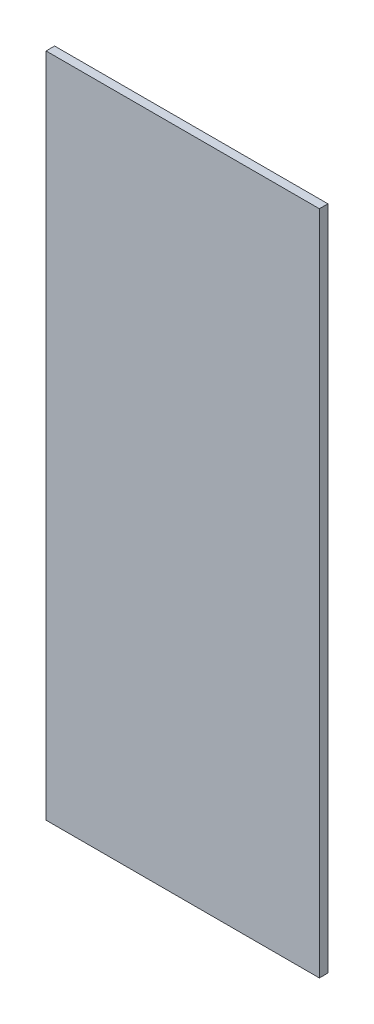
ISO-10303-21;
HEADER;
FILE_DESCRIPTION(('STEP AP214'),'2;1');
FILE_NAME('part.step','',(''),(''),'','','');
FILE_SCHEMA(('AUTOMOTIVE_DESIGN { 1 0 10303 214 1 1 1 1 }'));
ENDSEC;
DATA;
#1=APPLICATION_CONTEXT('core data for automotive mechanical design processes');
#2=APPLICATION_PROTOCOL_DEFINITION('international standard','automotive_design',2000,#1);
#3=PRODUCT_CONTEXT('',#1,'mechanical');
#4=PRODUCT('Part','Part','',(#3));
#5=PRODUCT_RELATED_PRODUCT_CATEGORY('part','',(#4));
#6=PRODUCT_DEFINITION_FORMATION('','',#4);
#7=PRODUCT_DEFINITION_CONTEXT('part definition',#1,'design');
#8=PRODUCT_DEFINITION('design','',#6,#7);
#9=PRODUCT_DEFINITION_SHAPE('','',#8);
#10=(LENGTH_UNIT() NAMED_UNIT(*) SI_UNIT(.MILLI.,.METRE.));
#11=(NAMED_UNIT(*) PLANE_ANGLE_UNIT() SI_UNIT($,.RADIAN.));
#12=(NAMED_UNIT(*) SI_UNIT($,.STERADIAN.) SOLID_ANGLE_UNIT());
#13=UNCERTAINTY_MEASURE_WITH_UNIT(LENGTH_MEASURE(1.E-05),#10,'distance_accuracy_value','');
#14=(GEOMETRIC_REPRESENTATION_CONTEXT(3) GLOBAL_UNCERTAINTY_ASSIGNED_CONTEXT((#13)) GLOBAL_UNIT_ASSIGNED_CONTEXT((#10,
#11,#12)) REPRESENTATION_CONTEXT('',''));
#15=CARTESIAN_POINT('',(0.,0.,0.));
#16=DIRECTION('',(0.,0.,1.));
#17=DIRECTION('',(1.,0.,0.));
#18=AXIS2_PLACEMENT_3D('',#15,#16,#17);
#19=CARTESIAN_POINT('',(101.6,495.3,-3.175));
#20=DIRECTION('',(-1.,0.,0.));
#21=DIRECTION('',(0.,0.,1.));
#22=AXIS2_PLACEMENT_3D('',#19,#20,#21);
#23=PLANE('',#22);
#24=DIRECTION('',(0.,0.,-1.));
#25=VECTOR('',#24,1.);
#26=CARTESIAN_POINT('',(101.6,0.,-3.175));
#27=LINE('',#26,#25);
#28=CARTESIAN_POINT('',(101.6,0.,3.175));
#29=VERTEX_POINT('',#28);
#30=CARTESIAN_POINT('',(101.6,0.,-3.175));
#31=VERTEX_POINT('',#30);
#32=EDGE_CURVE('E97',#29,#31,#27,.T.);
#33=ORIENTED_EDGE('',*,*,#32,.T.);
#34=DIRECTION('',(0.,-1.,0.));
#35=VECTOR('',#34,1.);
#36=CARTESIAN_POINT('',(101.6,495.3,-3.175));
#37=LINE('',#36,#35);
#38=CARTESIAN_POINT('',(101.6,495.3,-3.175));
#39=VERTEX_POINT('',#38);
#40=EDGE_CURVE('E11',#39,#31,#37,.T.);
#41=ORIENTED_EDGE('',*,*,#40,.F.);
#42=DIRECTION('',(0.,0.,-1.));
#43=VECTOR('',#42,1.);
#44=CARTESIAN_POINT('',(101.6,495.3,-3.175));
#45=LINE('',#44,#43);
#46=CARTESIAN_POINT('',(101.6,495.3,3.175));
#47=VERTEX_POINT('',#46);
#48=EDGE_CURVE('E85',#47,#39,#45,.T.);
#49=ORIENTED_EDGE('',*,*,#48,.F.);
#50=DIRECTION('',(0.,-1.,0.));
#51=VECTOR('',#50,1.);
#52=CARTESIAN_POINT('',(101.6,495.3,3.175));
#53=LINE('',#52,#51);
#54=EDGE_CURVE('E93',#47,#29,#53,.T.);
#55=ORIENTED_EDGE('',*,*,#54,.T.);
#56=EDGE_LOOP('',(#33,#41,#49,#55));
#57=FACE_BOUND('',#56,.T.);
#58=ADVANCED_FACE('F34',(#57),#23,.F.);
#59=CARTESIAN_POINT('',(-101.6,495.3,-3.175));
#60=DIRECTION('',(0.,0.,1.));
#61=DIRECTION('',(1.,0.,0.));
#62=AXIS2_PLACEMENT_3D('',#59,#60,#61);
#63=PLANE('',#62);
#64=DIRECTION('',(-1.,0.,0.));
#65=VECTOR('',#64,1.);
#66=CARTESIAN_POINT('',(-101.6,0.,-3.175));
#67=LINE('',#66,#65);
#68=CARTESIAN_POINT('',(-101.6,0.,-3.175));
#69=VERTEX_POINT('',#68);
#70=EDGE_CURVE('E89',#31,#69,#67,.T.);
#71=ORIENTED_EDGE('',*,*,#70,.T.);
#72=DIRECTION('',(0.,-1.,0.));
#73=VECTOR('',#72,1.);
#74=CARTESIAN_POINT('',(-101.6,495.3,-3.175));
#75=LINE('',#74,#73);
#76=CARTESIAN_POINT('',(-101.6,495.3,-3.175));
#77=VERTEX_POINT('',#76);
#78=EDGE_CURVE('E42',#77,#69,#75,.T.);
#79=ORIENTED_EDGE('',*,*,#78,.F.);
#80=DIRECTION('',(-1.,0.,0.));
#81=VECTOR('',#80,1.);
#82=CARTESIAN_POINT('',(-101.6,495.3,-3.175));
#83=LINE('',#82,#81);
#84=EDGE_CURVE('E80',#39,#77,#83,.T.);
#85=ORIENTED_EDGE('',*,*,#84,.F.);
#86=ORIENTED_EDGE('',*,*,#40,.T.);
#87=EDGE_LOOP('',(#71,#79,#85,#86));
#88=FACE_BOUND('',#87,.T.);
#89=ADVANCED_FACE('F88',(#88),#63,.F.);
#90=CARTESIAN_POINT('',(-101.6,495.3,-3.175));
#91=DIRECTION('',(1.,0.,0.));
#92=DIRECTION('',(0.,0.,-1.));
#93=AXIS2_PLACEMENT_3D('',#90,#91,#92);
#94=PLANE('',#93);
#95=DIRECTION('',(0.,0.,1.));
#96=VECTOR('',#95,1.);
#97=CARTESIAN_POINT('',(-101.6,0.,-3.175));
#98=LINE('',#97,#96);
#99=CARTESIAN_POINT('',(-101.6,0.,3.175));
#100=VERTEX_POINT('',#99);
#101=EDGE_CURVE('E67',#69,#100,#98,.T.);
#102=ORIENTED_EDGE('',*,*,#101,.T.);
#103=DIRECTION('',(0.,-1.,0.));
#104=VECTOR('',#103,1.);
#105=CARTESIAN_POINT('',(-101.6,495.3,3.175));
#106=LINE('',#105,#104);
#107=CARTESIAN_POINT('',(-101.6,495.3,3.175));
#108=VERTEX_POINT('',#107);
#109=EDGE_CURVE('E90',#108,#100,#106,.T.);
#110=ORIENTED_EDGE('',*,*,#109,.F.);
#111=DIRECTION('',(0.,0.,1.));
#112=VECTOR('',#111,1.);
#113=CARTESIAN_POINT('',(-101.6,495.3,-3.175));
#114=LINE('',#113,#112);
#115=EDGE_CURVE('E83',#77,#108,#114,.T.);
#116=ORIENTED_EDGE('',*,*,#115,.F.);
#117=ORIENTED_EDGE('',*,*,#78,.T.);
#118=EDGE_LOOP('',(#102,#110,#116,#117));
#119=FACE_BOUND('',#118,.T.);
#120=ADVANCED_FACE('F91',(#119),#94,.F.);
#121=CARTESIAN_POINT('',(-101.6,495.3,3.175));
#122=DIRECTION('',(0.,0.,-1.));
#123=DIRECTION('',(-1.,0.,0.));
#124=AXIS2_PLACEMENT_3D('',#121,#122,#123);
#125=PLANE('',#124);
#126=DIRECTION('',(1.,0.,0.));
#127=VECTOR('',#126,1.);
#128=CARTESIAN_POINT('',(-101.6,0.,3.175));
#129=LINE('',#128,#127);
#130=EDGE_CURVE('E73',#100,#29,#129,.T.);
#131=ORIENTED_EDGE('',*,*,#130,.T.);
#132=ORIENTED_EDGE('',*,*,#54,.F.);
#133=DIRECTION('',(1.,0.,0.));
#134=VECTOR('',#133,1.);
#135=CARTESIAN_POINT('',(-101.6,495.3,3.175));
#136=LINE('',#135,#134);
#137=EDGE_CURVE('E50',#108,#47,#136,.T.);
#138=ORIENTED_EDGE('',*,*,#137,.F.);
#139=ORIENTED_EDGE('',*,*,#109,.T.);
#140=EDGE_LOOP('',(#131,#132,#138,#139));
#141=FACE_BOUND('',#140,.T.);
#142=ADVANCED_FACE('F104',(#141),#125,.F.);
#143=CARTESIAN_POINT('',(0.,495.3,0.));
#144=DIRECTION('',(0.,1.,0.));
#145=DIRECTION('',(0.,0.,1.));
#146=AXIS2_PLACEMENT_3D('',#143,#144,#145);
#147=PLANE('',#146);
#148=ORIENTED_EDGE('',*,*,#48,.T.);
#149=ORIENTED_EDGE('',*,*,#84,.T.);
#150=ORIENTED_EDGE('',*,*,#115,.T.);
#151=ORIENTED_EDGE('',*,*,#137,.T.);
#152=EDGE_LOOP('',(#148,#149,#150,#151));
#153=FACE_BOUND('',#152,.T.);
#154=ADVANCED_FACE('F81',(#153),#147,.T.);
#155=CARTESIAN_POINT('',(0.,0.,0.));
#156=DIRECTION('',(0.,1.,0.));
#157=DIRECTION('',(0.,0.,1.));
#158=AXIS2_PLACEMENT_3D('',#155,#156,#157);
#159=PLANE('',#158);
#160=ORIENTED_EDGE('',*,*,#32,.F.);
#161=ORIENTED_EDGE('',*,*,#130,.F.);
#162=ORIENTED_EDGE('',*,*,#101,.F.);
#163=ORIENTED_EDGE('',*,*,#70,.F.);
#164=EDGE_LOOP('',(#160,#161,#162,#163));
#165=FACE_BOUND('',#164,.T.);
#166=ADVANCED_FACE('F107',(#165),#159,.F.);
#167=CLOSED_SHELL('',(#58,#89,#120,#142,#154,#166));
#168=MANIFOLD_SOLID_BREP('B2',#167);
#169=ADVANCED_BREP_SHAPE_REPRESENTATION('',(#18,#168),#14);
#170=SHAPE_DEFINITION_REPRESENTATION(#9,#169);
ENDSEC;
END-ISO-10303-21;
